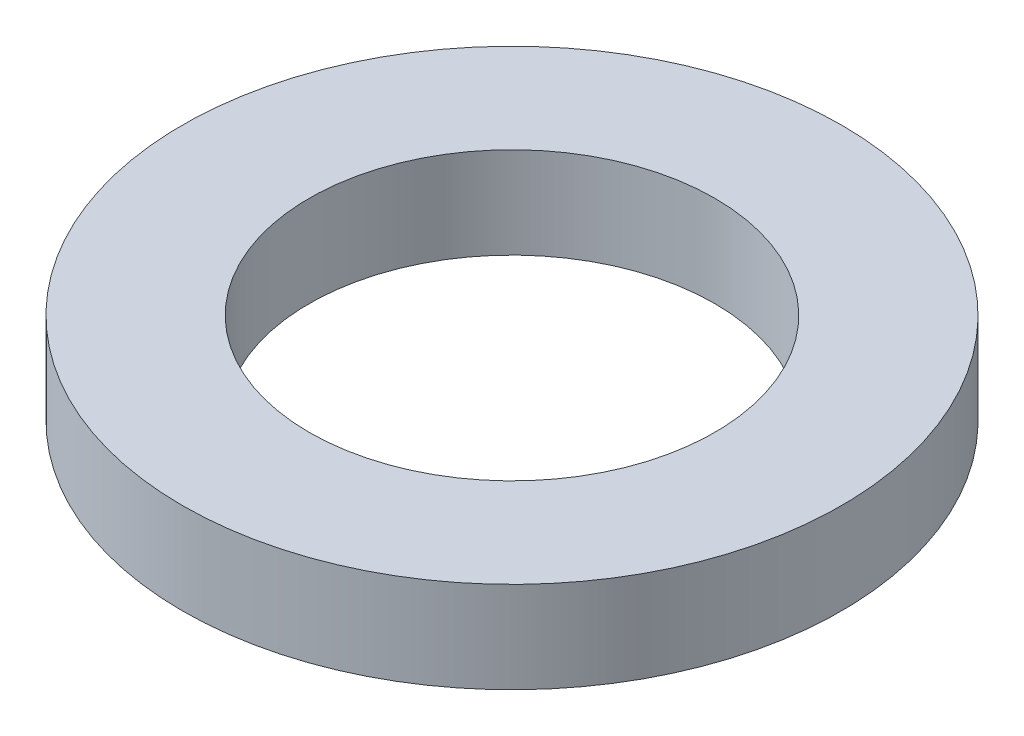
ISO-10303-21;
HEADER;
FILE_DESCRIPTION(('STEP AP214'),'2;1');
FILE_NAME('part.step','',(''),(''),'','','');
FILE_SCHEMA(('AUTOMOTIVE_DESIGN { 1 0 10303 214 1 1 1 1 }'));
ENDSEC;
DATA;
#1=APPLICATION_CONTEXT('core data for automotive mechanical design processes');
#2=APPLICATION_PROTOCOL_DEFINITION('international standard','automotive_design',2000,#1);
#3=PRODUCT_CONTEXT('',#1,'mechanical');
#4=PRODUCT('Part','Part','',(#3));
#5=PRODUCT_RELATED_PRODUCT_CATEGORY('part','',(#4));
#6=PRODUCT_DEFINITION_FORMATION('','',#4);
#7=PRODUCT_DEFINITION_CONTEXT('part definition',#1,'design');
#8=PRODUCT_DEFINITION('design','',#6,#7);
#9=PRODUCT_DEFINITION_SHAPE('','',#8);
#10=(LENGTH_UNIT() NAMED_UNIT(*) SI_UNIT(.MILLI.,.METRE.));
#11=(NAMED_UNIT(*) PLANE_ANGLE_UNIT() SI_UNIT($,.RADIAN.));
#12=(NAMED_UNIT(*) SI_UNIT($,.STERADIAN.) SOLID_ANGLE_UNIT());
#13=UNCERTAINTY_MEASURE_WITH_UNIT(LENGTH_MEASURE(1.E-05),#10,'distance_accuracy_value','');
#14=(GEOMETRIC_REPRESENTATION_CONTEXT(3) GLOBAL_UNCERTAINTY_ASSIGNED_CONTEXT((#13)) GLOBAL_UNIT_ASSIGNED_CONTEXT((#10,
#11,#12)) REPRESENTATION_CONTEXT('',''));
#15=CARTESIAN_POINT('',(0.,0.,0.));
#16=DIRECTION('',(0.,0.,1.));
#17=DIRECTION('',(1.,0.,0.));
#18=AXIS2_PLACEMENT_3D('',#15,#16,#17);
#19=CARTESIAN_POINT('',(0.,9.,0.));
#20=DIRECTION('',(0.,-1.,0.));
#21=DIRECTION('',(0.,0.,-1.));
#22=AXIS2_PLACEMENT_3D('',#19,#20,#21);
#23=CYLINDRICAL_SURFACE('',#22,32.5);
#24=CARTESIAN_POINT('',(0.,9.,0.));
#25=DIRECTION('',(0.,1.,0.));
#26=DIRECTION('',(0.,0.,1.));
#27=AXIS2_PLACEMENT_3D('',#24,#25,#26);
#28=CIRCLE('',#27,32.5);
#29=CARTESIAN_POINT('',(0.,9.,32.5));
#30=VERTEX_POINT('',#29);
#31=EDGE_CURVE('E10',#30,#30,#28,.T.);
#32=ORIENTED_EDGE('',*,*,#31,.F.);
#33=EDGE_LOOP('',(#32));
#34=FACE_BOUND('',#33,.T.);
#35=CARTESIAN_POINT('',(0.,0.,0.));
#36=DIRECTION('',(0.,1.,0.));
#37=DIRECTION('',(0.,0.,1.));
#38=AXIS2_PLACEMENT_3D('',#35,#36,#37);
#39=CIRCLE('',#38,32.5);
#40=CARTESIAN_POINT('',(0.,0.,32.5));
#41=VERTEX_POINT('',#40);
#42=EDGE_CURVE('E37',#41,#41,#39,.T.);
#43=ORIENTED_EDGE('',*,*,#42,.T.);
#44=EDGE_LOOP('',(#43));
#45=FACE_BOUND('',#44,.T.);
#46=ADVANCED_FACE('F40',(#34,#45),#23,.T.);
#47=CARTESIAN_POINT('',(0.,9.,0.));
#48=DIRECTION('',(0.,1.,0.));
#49=DIRECTION('',(0.,0.,1.));
#50=AXIS2_PLACEMENT_3D('',#47,#48,#49);
#51=PLANE('',#50);
#52=CARTESIAN_POINT('',(0.,9.,0.));
#53=DIRECTION('',(0.,1.,0.));
#54=DIRECTION('',(0.,0.,1.));
#55=AXIS2_PLACEMENT_3D('',#52,#53,#54);
#56=CIRCLE('',#55,20.);
#57=CARTESIAN_POINT('',(0.,9.,20.));
#58=VERTEX_POINT('',#57);
#59=EDGE_CURVE('E50',#58,#58,#56,.T.);
#60=ORIENTED_EDGE('',*,*,#59,.F.);
#61=EDGE_LOOP('',(#60));
#62=FACE_BOUND('',#61,.T.);
#63=ORIENTED_EDGE('',*,*,#31,.T.);
#64=EDGE_LOOP('',(#63));
#65=FACE_BOUND('',#64,.T.);
#66=ADVANCED_FACE('F59',(#62,#65),#51,.T.);
#67=CARTESIAN_POINT('',(0.,0.,0.));
#68=DIRECTION('',(0.,1.,0.));
#69=DIRECTION('',(0.,0.,1.));
#70=AXIS2_PLACEMENT_3D('',#67,#68,#69);
#71=PLANE('',#70);
#72=CARTESIAN_POINT('',(0.,0.,0.));
#73=DIRECTION('',(0.,1.,0.));
#74=DIRECTION('',(0.,0.,1.));
#75=AXIS2_PLACEMENT_3D('',#72,#73,#74);
#76=CIRCLE('',#75,20.);
#77=CARTESIAN_POINT('',(0.,0.,20.));
#78=VERTEX_POINT('',#77);
#79=EDGE_CURVE('E47',#78,#78,#76,.T.);
#80=ORIENTED_EDGE('',*,*,#79,.T.);
#81=EDGE_LOOP('',(#80));
#82=FACE_BOUND('',#81,.T.);
#83=ORIENTED_EDGE('',*,*,#42,.F.);
#84=EDGE_LOOP('',(#83));
#85=FACE_BOUND('',#84,.T.);
#86=ADVANCED_FACE('F58',(#82,#85),#71,.F.);
#87=CARTESIAN_POINT('',(0.,9.,0.));
#88=DIRECTION('',(0.,-1.,0.));
#89=DIRECTION('',(0.,0.,-1.));
#90=AXIS2_PLACEMENT_3D('',#87,#88,#89);
#91=CYLINDRICAL_SURFACE('',#90,20.);
#92=ORIENTED_EDGE('',*,*,#59,.T.);
#93=EDGE_LOOP('',(#92));
#94=FACE_BOUND('',#93,.T.);
#95=ORIENTED_EDGE('',*,*,#79,.F.);
#96=EDGE_LOOP('',(#95));
#97=FACE_BOUND('',#96,.T.);
#98=ADVANCED_FACE('F54',(#94,#97),#91,.F.);
#99=CLOSED_SHELL('',(#46,#66,#86,#98));
#100=MANIFOLD_SOLID_BREP('B2',#99);
#101=ADVANCED_BREP_SHAPE_REPRESENTATION('',(#18,#100),#14);
#102=SHAPE_DEFINITION_REPRESENTATION(#9,#101);
ENDSEC;
END-ISO-10303-21;
